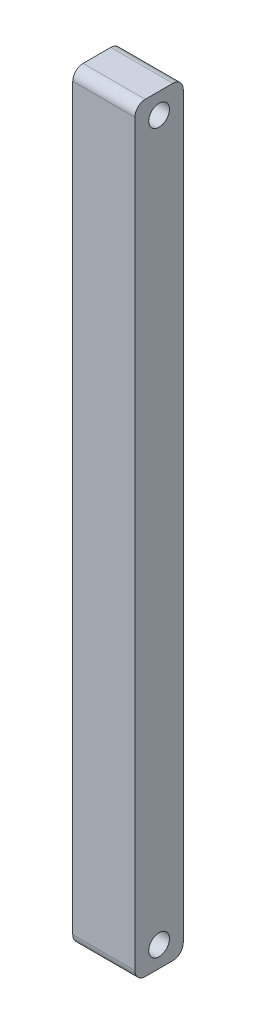
ISO-10303-21;
HEADER;
FILE_DESCRIPTION(('STEP AP214'),'2;1');
FILE_NAME('part.step','',(''),(''),'','','');
FILE_SCHEMA(('AUTOMOTIVE_DESIGN { 1 0 10303 214 1 1 1 1 }'));
ENDSEC;
DATA;
#1=APPLICATION_CONTEXT('core data for automotive mechanical design processes');
#2=APPLICATION_PROTOCOL_DEFINITION('international standard','automotive_design',2000,#1);
#3=PRODUCT_CONTEXT('',#1,'mechanical');
#4=PRODUCT('Part','Part','',(#3));
#5=PRODUCT_RELATED_PRODUCT_CATEGORY('part','',(#4));
#6=PRODUCT_DEFINITION_FORMATION('','',#4);
#7=PRODUCT_DEFINITION_CONTEXT('part definition',#1,'design');
#8=PRODUCT_DEFINITION('design','',#6,#7);
#9=PRODUCT_DEFINITION_SHAPE('','',#8);
#10=(LENGTH_UNIT() NAMED_UNIT(*) SI_UNIT(.MILLI.,.METRE.));
#11=(NAMED_UNIT(*) PLANE_ANGLE_UNIT() SI_UNIT($,.RADIAN.));
#12=(NAMED_UNIT(*) SI_UNIT($,.STERADIAN.) SOLID_ANGLE_UNIT());
#13=UNCERTAINTY_MEASURE_WITH_UNIT(LENGTH_MEASURE(1.E-05),#10,'distance_accuracy_value','');
#14=(GEOMETRIC_REPRESENTATION_CONTEXT(3) GLOBAL_UNCERTAINTY_ASSIGNED_CONTEXT((#13)) GLOBAL_UNIT_ASSIGNED_CONTEXT((#10,
#11,#12)) REPRESENTATION_CONTEXT('',''));
#15=CARTESIAN_POINT('',(0.,0.,0.));
#16=DIRECTION('',(0.,0.,1.));
#17=DIRECTION('',(1.,0.,0.));
#18=AXIS2_PLACEMENT_3D('',#15,#16,#17);
#19=CARTESIAN_POINT('',(-0.545161290322583,-0.937788018433181,7.));
#20=DIRECTION('',(0.,1.,0.));
#21=DIRECTION('',(-1.,0.,0.));
#22=AXIS2_PLACEMENT_3D('',#19,#20,#21);
#23=PLANE('',#22);
#24=DIRECTION('',(0.,0.,-1.));
#25=VECTOR('',#24,1.);
#26=CARTESIAN_POINT('',(-0.545161290322583,-0.937788018433181,7.));
#27=LINE('',#26,#25);
#28=CARTESIAN_POINT('',(-0.545161290322583,-0.937788018433181,5.5));
#29=VERTEX_POINT('',#28);
#30=CARTESIAN_POINT('',(-0.545161290322583,-0.937788018433181,1.5));
#31=VERTEX_POINT('',#30);
#32=EDGE_CURVE('E127',#29,#31,#27,.T.);
#33=ORIENTED_EDGE('',*,*,#32,.T.);
#34=DIRECTION('',(1.,0.,0.));
#35=VECTOR('',#34,1.);
#36=CARTESIAN_POINT('',(-0.545161290322583,-0.937788018433181,1.5));
#37=LINE('',#36,#35);
#38=CARTESIAN_POINT('',(8.45483870967742,-0.93778801843318,1.5));
#39=VERTEX_POINT('',#38);
#40=EDGE_CURVE('E153',#31,#39,#37,.T.);
#41=ORIENTED_EDGE('',*,*,#40,.T.);
#42=DIRECTION('',(0.,0.,-1.));
#43=VECTOR('',#42,1.);
#44=CARTESIAN_POINT('',(8.45483870967742,-0.93778801843318,7.));
#45=LINE('',#44,#43);
#46=CARTESIAN_POINT('',(8.45483870967742,-0.93778801843318,5.5));
#47=VERTEX_POINT('',#46);
#48=EDGE_CURVE('E133',#47,#39,#45,.T.);
#49=ORIENTED_EDGE('',*,*,#48,.F.);
#50=DIRECTION('',(1.,0.,0.));
#51=VECTOR('',#50,1.);
#52=CARTESIAN_POINT('',(-0.545161290322583,-0.937788018433181,5.5));
#53=LINE('',#52,#51);
#54=EDGE_CURVE('E150',#47,#29,#53,.F.);
#55=ORIENTED_EDGE('',*,*,#54,.T.);
#56=EDGE_LOOP('',(#33,#41,#49,#55));
#57=FACE_BOUND('',#56,.T.);
#58=ADVANCED_FACE('F37',(#57),#23,.F.);
#59=CARTESIAN_POINT('',(8.45483870967742,-0.93778801843318,7.));
#60=DIRECTION('',(-1.,0.,0.));
#61=DIRECTION('',(0.,0.,1.));
#62=AXIS2_PLACEMENT_3D('',#59,#60,#61);
#63=PLANE('',#62);
#64=CARTESIAN_POINT('',(8.45483870967742,106.062211981567,3.5));
#65=DIRECTION('',(1.,0.,0.));
#66=DIRECTION('',(0.,0.,-1.));
#67=AXIS2_PLACEMENT_3D('',#64,#65,#66);
#68=CIRCLE('',#67,1.5);
#69=CARTESIAN_POINT('',(8.45483870967742,106.062211981567,2.));
#70=VERTEX_POINT('',#69);
#71=EDGE_CURVE('E236',#70,#70,#68,.T.);
#72=ORIENTED_EDGE('',*,*,#71,.F.);
#73=EDGE_LOOP('',(#72));
#74=FACE_BOUND('',#73,.T.);
#75=CARTESIAN_POINT('',(8.45483870967742,2.06221198156682,3.5));
#76=DIRECTION('',(1.,0.,0.));
#77=DIRECTION('',(0.,0.,-1.));
#78=AXIS2_PLACEMENT_3D('',#75,#76,#77);
#79=CIRCLE('',#78,1.5);
#80=CARTESIAN_POINT('',(8.45483870967742,2.06221198156682,2.));
#81=VERTEX_POINT('',#80);
#82=EDGE_CURVE('E187',#81,#81,#79,.T.);
#83=ORIENTED_EDGE('',*,*,#82,.F.);
#84=EDGE_LOOP('',(#83));
#85=FACE_BOUND('',#84,.T.);
#86=ORIENTED_EDGE('',*,*,#48,.T.);
#87=CARTESIAN_POINT('',(8.45483870967742,0.56221198156682,1.5));
#88=DIRECTION('',(-1.,0.,0.));
#89=DIRECTION('',(0.,0.,1.));
#90=AXIS2_PLACEMENT_3D('',#87,#88,#89);
#91=CIRCLE('',#90,1.5);
#92=CARTESIAN_POINT('',(8.45483870967742,0.56221198156682,0.));
#93=VERTEX_POINT('',#92);
#94=EDGE_CURVE('E160',#39,#93,#91,.F.);
#95=ORIENTED_EDGE('',*,*,#94,.T.);
#96=DIRECTION('',(0.,1.,0.));
#97=VECTOR('',#96,1.);
#98=CARTESIAN_POINT('',(8.45483870967742,-0.93778801843318,0.));
#99=LINE('',#98,#97);
#100=CARTESIAN_POINT('',(8.45483870967742,107.562211981567,0.));
#101=VERTEX_POINT('',#100);
#102=EDGE_CURVE('E177',#93,#101,#99,.T.);
#103=ORIENTED_EDGE('',*,*,#102,.T.);
#104=CARTESIAN_POINT('',(8.45483870967742,107.562211981567,1.5));
#105=DIRECTION('',(-1.,0.,0.));
#106=DIRECTION('',(0.,0.,1.));
#107=AXIS2_PLACEMENT_3D('',#104,#105,#106);
#108=CIRCLE('',#107,1.5);
#109=CARTESIAN_POINT('',(8.45483870967742,109.062211981567,1.5));
#110=VERTEX_POINT('',#109);
#111=EDGE_CURVE('E146',#101,#110,#108,.F.);
#112=ORIENTED_EDGE('',*,*,#111,.T.);
#113=DIRECTION('',(0.,0.,-1.));
#114=VECTOR('',#113,1.);
#115=CARTESIAN_POINT('',(8.45483870967742,109.062211981567,7.));
#116=LINE('',#115,#114);
#117=CARTESIAN_POINT('',(8.45483870967742,109.062211981567,5.5));
#118=VERTEX_POINT('',#117);
#119=EDGE_CURVE('E126',#118,#110,#116,.T.);
#120=ORIENTED_EDGE('',*,*,#119,.F.);
#121=CARTESIAN_POINT('',(8.45483870967742,107.562211981567,5.5));
#122=DIRECTION('',(-1.,0.,0.));
#123=DIRECTION('',(0.,0.,1.));
#124=AXIS2_PLACEMENT_3D('',#121,#122,#123);
#125=CIRCLE('',#124,1.5);
#126=CARTESIAN_POINT('',(8.45483870967742,107.562211981567,7.));
#127=VERTEX_POINT('',#126);
#128=EDGE_CURVE('E132',#118,#127,#125,.F.);
#129=ORIENTED_EDGE('',*,*,#128,.T.);
#130=DIRECTION('',(0.,1.,0.));
#131=VECTOR('',#130,1.);
#132=CARTESIAN_POINT('',(8.45483870967742,-0.93778801843318,7.));
#133=LINE('',#132,#131);
#134=CARTESIAN_POINT('',(8.45483870967742,0.56221198156682,7.));
#135=VERTEX_POINT('',#134);
#136=EDGE_CURVE('E184',#135,#127,#133,.T.);
#137=ORIENTED_EDGE('',*,*,#136,.F.);
#138=CARTESIAN_POINT('',(8.45483870967742,0.56221198156682,5.5));
#139=DIRECTION('',(-1.,0.,0.));
#140=DIRECTION('',(0.,0.,1.));
#141=AXIS2_PLACEMENT_3D('',#138,#139,#140);
#142=CIRCLE('',#141,1.5);
#143=EDGE_CURVE('E157',#135,#47,#142,.F.);
#144=ORIENTED_EDGE('',*,*,#143,.T.);
#145=EDGE_LOOP('',(#86,#95,#103,#112,#120,#129,#137,#144));
#146=FACE_BOUND('',#145,.T.);
#147=ADVANCED_FACE('F176',(#74,#85,#146),#63,.F.);
#148=CARTESIAN_POINT('',(-0.545161290322583,109.062211981567,7.));
#149=DIRECTION('',(0.,-1.,0.));
#150=DIRECTION('',(0.,0.,-1.));
#151=AXIS2_PLACEMENT_3D('',#148,#149,#150);
#152=PLANE('',#151);
#153=ORIENTED_EDGE('',*,*,#119,.T.);
#154=DIRECTION('',(-1.,0.,0.));
#155=VECTOR('',#154,1.);
#156=CARTESIAN_POINT('',(-0.545161290322583,109.062211981567,1.5));
#157=LINE('',#156,#155);
#158=CARTESIAN_POINT('',(-0.545161290322583,109.062211981567,1.5));
#159=VERTEX_POINT('',#158);
#160=EDGE_CURVE('E117',#110,#159,#157,.T.);
#161=ORIENTED_EDGE('',*,*,#160,.T.);
#162=DIRECTION('',(0.,0.,-1.));
#163=VECTOR('',#162,1.);
#164=CARTESIAN_POINT('',(-0.545161290322583,109.062211981567,7.));
#165=LINE('',#164,#163);
#166=CARTESIAN_POINT('',(-0.545161290322583,109.062211981567,5.5));
#167=VERTEX_POINT('',#166);
#168=EDGE_CURVE('E110',#167,#159,#165,.T.);
#169=ORIENTED_EDGE('',*,*,#168,.F.);
#170=DIRECTION('',(-1.,0.,0.));
#171=VECTOR('',#170,1.);
#172=CARTESIAN_POINT('',(8.45483870967742,109.062211981567,5.5));
#173=LINE('',#172,#171);
#174=EDGE_CURVE('E123',#167,#118,#173,.F.);
#175=ORIENTED_EDGE('',*,*,#174,.T.);
#176=EDGE_LOOP('',(#153,#161,#169,#175));
#177=FACE_BOUND('',#176,.T.);
#178=ADVANCED_FACE('F122',(#177),#152,.F.);
#179=CARTESIAN_POINT('',(-0.545161290322583,-0.937788018433181,7.));
#180=DIRECTION('',(1.,0.,0.));
#181=DIRECTION('',(0.,0.,-1.));
#182=AXIS2_PLACEMENT_3D('',#179,#180,#181);
#183=PLANE('',#182);
#184=CARTESIAN_POINT('',(-0.545161290322583,106.062211981567,3.5));
#185=DIRECTION('',(1.,0.,0.));
#186=DIRECTION('',(0.,0.,-1.));
#187=AXIS2_PLACEMENT_3D('',#184,#185,#186);
#188=CIRCLE('',#187,1.5);
#189=CARTESIAN_POINT('',(-0.545161290322583,106.062211981567,2.));
#190=VERTEX_POINT('',#189);
#191=EDGE_CURVE('E233',#190,#190,#188,.T.);
#192=ORIENTED_EDGE('',*,*,#191,.T.);
#193=EDGE_LOOP('',(#192));
#194=FACE_BOUND('',#193,.T.);
#195=CARTESIAN_POINT('',(-0.545161290322583,2.06221198156682,3.5));
#196=DIRECTION('',(1.,0.,0.));
#197=DIRECTION('',(0.,0.,-1.));
#198=AXIS2_PLACEMENT_3D('',#195,#196,#197);
#199=CIRCLE('',#198,1.5);
#200=CARTESIAN_POINT('',(-0.545161290322583,2.06221198156682,2.));
#201=VERTEX_POINT('',#200);
#202=EDGE_CURVE('E182',#201,#201,#199,.T.);
#203=ORIENTED_EDGE('',*,*,#202,.T.);
#204=EDGE_LOOP('',(#203));
#205=FACE_BOUND('',#204,.T.);
#206=DIRECTION('',(0.,-1.,0.));
#207=VECTOR('',#206,1.);
#208=CARTESIAN_POINT('',(-0.545161290322583,-0.937788018433181,0.));
#209=LINE('',#208,#207);
#210=CARTESIAN_POINT('',(-0.545161290322583,107.562211981567,0.));
#211=VERTEX_POINT('',#210);
#212=CARTESIAN_POINT('',(-0.545161290322583,0.562211981566819,0.));
#213=VERTEX_POINT('',#212);
#214=EDGE_CURVE('E167',#211,#213,#209,.T.);
#215=ORIENTED_EDGE('',*,*,#214,.T.);
#216=CARTESIAN_POINT('',(-0.545161290322583,0.562211981566819,1.5));
#217=DIRECTION('',(1.,0.,0.));
#218=DIRECTION('',(0.,0.,-1.));
#219=AXIS2_PLACEMENT_3D('',#216,#217,#218);
#220=CIRCLE('',#219,1.5);
#221=EDGE_CURVE('E45',#213,#31,#220,.F.);
#222=ORIENTED_EDGE('',*,*,#221,.T.);
#223=ORIENTED_EDGE('',*,*,#32,.F.);
#224=CARTESIAN_POINT('',(-0.545161290322583,0.562211981566819,5.5));
#225=DIRECTION('',(1.,0.,0.));
#226=DIRECTION('',(0.,0.,-1.));
#227=AXIS2_PLACEMENT_3D('',#224,#225,#226);
#228=CIRCLE('',#227,1.5);
#229=CARTESIAN_POINT('',(-0.545161290322583,0.562211981566819,7.));
#230=VERTEX_POINT('',#229);
#231=EDGE_CURVE('E52',#29,#230,#228,.F.);
#232=ORIENTED_EDGE('',*,*,#231,.T.);
#233=DIRECTION('',(0.,-1.,0.));
#234=VECTOR('',#233,1.);
#235=CARTESIAN_POINT('',(-0.545161290322583,-0.937788018433181,7.));
#236=LINE('',#235,#234);
#237=CARTESIAN_POINT('',(-0.545161290322583,107.562211981567,7.));
#238=VERTEX_POINT('',#237);
#239=EDGE_CURVE('E111',#238,#230,#236,.T.);
#240=ORIENTED_EDGE('',*,*,#239,.F.);
#241=CARTESIAN_POINT('',(-0.545161290322583,107.562211981567,5.5));
#242=DIRECTION('',(1.,0.,0.));
#243=DIRECTION('',(0.,0.,-1.));
#244=AXIS2_PLACEMENT_3D('',#241,#242,#243);
#245=CIRCLE('',#244,1.5);
#246=EDGE_CURVE('E107',#238,#167,#245,.F.);
#247=ORIENTED_EDGE('',*,*,#246,.T.);
#248=ORIENTED_EDGE('',*,*,#168,.T.);
#249=CARTESIAN_POINT('',(-0.545161290322583,107.562211981567,1.5));
#250=DIRECTION('',(1.,0.,0.));
#251=DIRECTION('',(0.,0.,-1.));
#252=AXIS2_PLACEMENT_3D('',#249,#250,#251);
#253=CIRCLE('',#252,1.5);
#254=EDGE_CURVE('E116',#159,#211,#253,.F.);
#255=ORIENTED_EDGE('',*,*,#254,.T.);
#256=EDGE_LOOP('',(#215,#222,#223,#232,#240,#247,#248,#255));
#257=FACE_BOUND('',#256,.T.);
#258=ADVANCED_FACE('F109',(#194,#205,#257),#183,.F.);
#259=CARTESIAN_POINT('',(0.,0.,7.));
#260=DIRECTION('',(0.,0.,1.));
#261=DIRECTION('',(1.,0.,0.));
#262=AXIS2_PLACEMENT_3D('',#259,#260,#261);
#263=PLANE('',#262);
#264=ORIENTED_EDGE('',*,*,#239,.T.);
#265=DIRECTION('',(1.,0.,0.));
#266=VECTOR('',#265,1.);
#267=CARTESIAN_POINT('',(8.45483870967742,0.56221198156682,7.));
#268=LINE('',#267,#266);
#269=EDGE_CURVE('E11',#230,#135,#268,.T.);
#270=ORIENTED_EDGE('',*,*,#269,.T.);
#271=ORIENTED_EDGE('',*,*,#136,.T.);
#272=DIRECTION('',(-1.,0.,0.));
#273=VECTOR('',#272,1.);
#274=CARTESIAN_POINT('',(-0.545161290322583,107.562211981567,7.));
#275=LINE('',#274,#273);
#276=EDGE_CURVE('E148',#127,#238,#275,.T.);
#277=ORIENTED_EDGE('',*,*,#276,.T.);
#278=EDGE_LOOP('',(#264,#270,#271,#277));
#279=FACE_BOUND('',#278,.T.);
#280=ADVANCED_FACE('F216',(#279),#263,.T.);
#281=CARTESIAN_POINT('',(0.,0.,0.));
#282=DIRECTION('',(0.,0.,1.));
#283=DIRECTION('',(1.,0.,0.));
#284=AXIS2_PLACEMENT_3D('',#281,#282,#283);
#285=PLANE('',#284);
#286=ORIENTED_EDGE('',*,*,#102,.F.);
#287=DIRECTION('',(1.,0.,0.));
#288=VECTOR('',#287,1.);
#289=CARTESIAN_POINT('',(0.,0.562211981566819,0.));
#290=LINE('',#289,#288);
#291=EDGE_CURVE('E60',#93,#213,#290,.F.);
#292=ORIENTED_EDGE('',*,*,#291,.T.);
#293=ORIENTED_EDGE('',*,*,#214,.F.);
#294=DIRECTION('',(-1.,0.,0.));
#295=VECTOR('',#294,1.);
#296=CARTESIAN_POINT('',(0.,107.562211981567,0.));
#297=LINE('',#296,#295);
#298=EDGE_CURVE('E142',#211,#101,#297,.F.);
#299=ORIENTED_EDGE('',*,*,#298,.T.);
#300=EDGE_LOOP('',(#286,#292,#293,#299));
#301=FACE_BOUND('',#300,.T.);
#302=ADVANCED_FACE('F178',(#301),#285,.F.);
#303=CARTESIAN_POINT('',(-0.545161290322583,2.06221198156682,3.5));
#304=DIRECTION('',(1.,0.,0.));
#305=DIRECTION('',(0.,0.,-1.));
#306=AXIS2_PLACEMENT_3D('',#303,#304,#305);
#307=CYLINDRICAL_SURFACE('',#306,1.5);
#308=ORIENTED_EDGE('',*,*,#202,.F.);
#309=EDGE_LOOP('',(#308));
#310=FACE_BOUND('',#309,.T.);
#311=ORIENTED_EDGE('',*,*,#82,.T.);
#312=EDGE_LOOP('',(#311));
#313=FACE_BOUND('',#312,.T.);
#314=ADVANCED_FACE('F201',(#310,#313),#307,.F.);
#315=CARTESIAN_POINT('',(-0.545161290322583,106.062211981567,3.5));
#316=DIRECTION('',(1.,0.,0.));
#317=DIRECTION('',(0.,0.,-1.));
#318=AXIS2_PLACEMENT_3D('',#315,#316,#317);
#319=CYLINDRICAL_SURFACE('',#318,1.5);
#320=ORIENTED_EDGE('',*,*,#191,.F.);
#321=EDGE_LOOP('',(#320));
#322=FACE_BOUND('',#321,.T.);
#323=ORIENTED_EDGE('',*,*,#71,.T.);
#324=EDGE_LOOP('',(#323));
#325=FACE_BOUND('',#324,.T.);
#326=ADVANCED_FACE('F194',(#322,#325),#319,.F.);
#327=CARTESIAN_POINT('',(-0.545161290322583,107.562211981567,1.5));
#328=DIRECTION('',(-1.,0.,0.));
#329=DIRECTION('',(0.,0.,1.));
#330=AXIS2_PLACEMENT_3D('',#327,#328,#329);
#331=CYLINDRICAL_SURFACE('',#330,1.5);
#332=ORIENTED_EDGE('',*,*,#111,.F.);
#333=ORIENTED_EDGE('',*,*,#298,.F.);
#334=ORIENTED_EDGE('',*,*,#254,.F.);
#335=ORIENTED_EDGE('',*,*,#160,.F.);
#336=EDGE_LOOP('',(#332,#333,#334,#335));
#337=FACE_BOUND('',#336,.T.);
#338=ADVANCED_FACE('F192',(#337),#331,.T.);
#339=CARTESIAN_POINT('',(0.,107.562211981567,5.5));
#340=DIRECTION('',(1.,0.,0.));
#341=DIRECTION('',(0.,0.,-1.));
#342=AXIS2_PLACEMENT_3D('',#339,#340,#341);
#343=CYLINDRICAL_SURFACE('',#342,1.5);
#344=ORIENTED_EDGE('',*,*,#128,.F.);
#345=ORIENTED_EDGE('',*,*,#174,.F.);
#346=ORIENTED_EDGE('',*,*,#246,.F.);
#347=ORIENTED_EDGE('',*,*,#276,.F.);
#348=EDGE_LOOP('',(#344,#345,#346,#347));
#349=FACE_BOUND('',#348,.T.);
#350=ADVANCED_FACE('F130',(#349),#343,.T.);
#351=CARTESIAN_POINT('',(-0.545161290322583,0.562211981566819,1.5));
#352=DIRECTION('',(1.,0.,0.));
#353=DIRECTION('',(0.,1.,0.));
#354=AXIS2_PLACEMENT_3D('',#351,#352,#353);
#355=CYLINDRICAL_SURFACE('',#354,1.5);
#356=ORIENTED_EDGE('',*,*,#221,.F.);
#357=ORIENTED_EDGE('',*,*,#291,.F.);
#358=ORIENTED_EDGE('',*,*,#94,.F.);
#359=ORIENTED_EDGE('',*,*,#40,.F.);
#360=EDGE_LOOP('',(#356,#357,#358,#359));
#361=FACE_BOUND('',#360,.T.);
#362=ADVANCED_FACE('F174',(#361),#355,.T.);
#363=CARTESIAN_POINT('',(0.,0.562211981566819,5.5));
#364=DIRECTION('',(-1.,0.,0.));
#365=DIRECTION('',(0.,-1.,0.));
#366=AXIS2_PLACEMENT_3D('',#363,#364,#365);
#367=CYLINDRICAL_SURFACE('',#366,1.5);
#368=ORIENTED_EDGE('',*,*,#231,.F.);
#369=ORIENTED_EDGE('',*,*,#54,.F.);
#370=ORIENTED_EDGE('',*,*,#143,.F.);
#371=ORIENTED_EDGE('',*,*,#269,.F.);
#372=EDGE_LOOP('',(#368,#369,#370,#371));
#373=FACE_BOUND('',#372,.T.);
#374=ADVANCED_FACE('F39',(#373),#367,.T.);
#375=CLOSED_SHELL('',(#58,#147,#178,#258,#280,#302,#314,#326,#338,#350,#362,#374));
#376=MANIFOLD_SOLID_BREP('B2',#375);
#377=ADVANCED_BREP_SHAPE_REPRESENTATION('',(#18,#376),#14);
#378=SHAPE_DEFINITION_REPRESENTATION(#9,#377);
ENDSEC;
END-ISO-10303-21;
